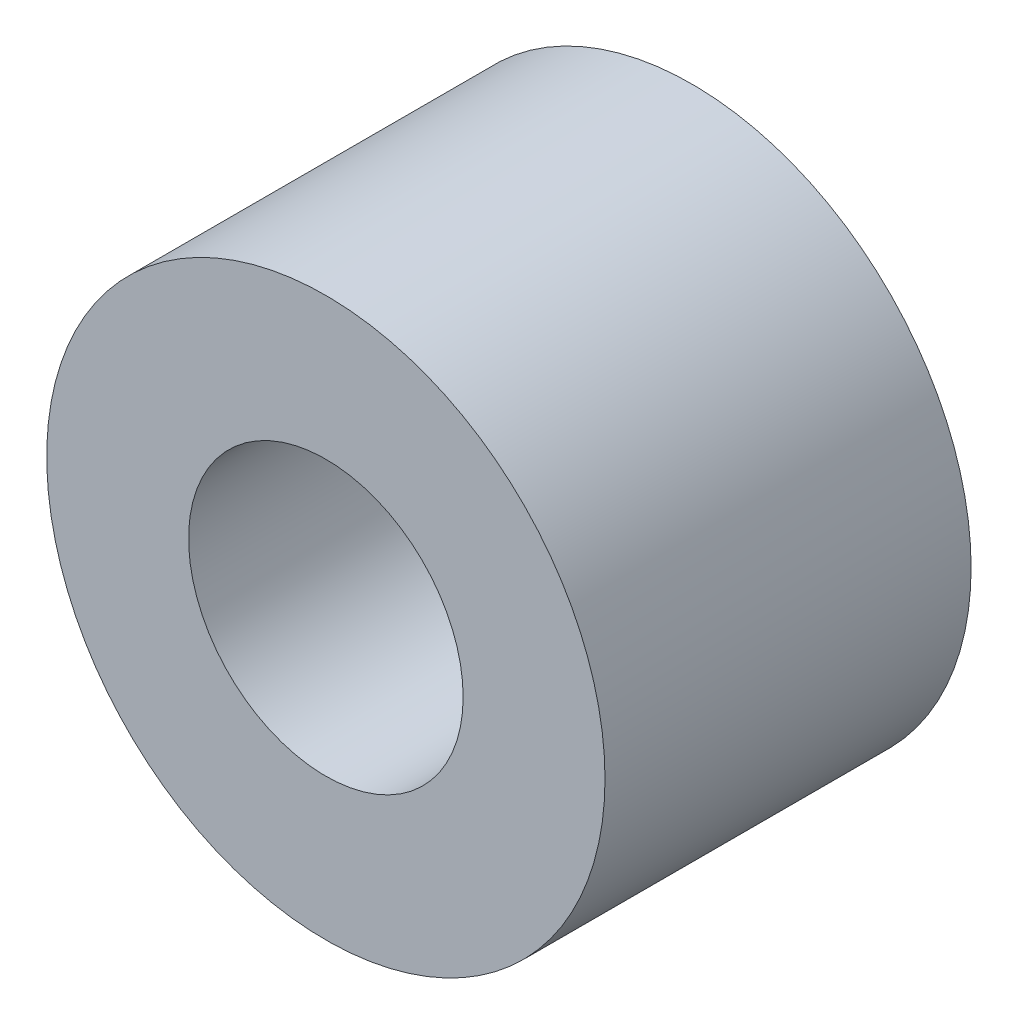
ISO-10303-21;
HEADER;
FILE_DESCRIPTION(('STEP AP214'),'2;1');
FILE_NAME('part.step','',(''),(''),'','','');
FILE_SCHEMA(('AUTOMOTIVE_DESIGN { 1 0 10303 214 1 1 1 1 }'));
ENDSEC;
DATA;
#1=APPLICATION_CONTEXT('core data for automotive mechanical design processes');
#2=APPLICATION_PROTOCOL_DEFINITION('international standard','automotive_design',2000,#1);
#3=PRODUCT_CONTEXT('',#1,'mechanical');
#4=PRODUCT('Part','Part','',(#3));
#5=PRODUCT_RELATED_PRODUCT_CATEGORY('part','',(#4));
#6=PRODUCT_DEFINITION_FORMATION('','',#4);
#7=PRODUCT_DEFINITION_CONTEXT('part definition',#1,'design');
#8=PRODUCT_DEFINITION('design','',#6,#7);
#9=PRODUCT_DEFINITION_SHAPE('','',#8);
#10=(LENGTH_UNIT() NAMED_UNIT(*) SI_UNIT(.MILLI.,.METRE.));
#11=(NAMED_UNIT(*) PLANE_ANGLE_UNIT() SI_UNIT($,.RADIAN.));
#12=(NAMED_UNIT(*) SI_UNIT($,.STERADIAN.) SOLID_ANGLE_UNIT());
#13=UNCERTAINTY_MEASURE_WITH_UNIT(LENGTH_MEASURE(1.E-05),#10,'distance_accuracy_value','');
#14=(GEOMETRIC_REPRESENTATION_CONTEXT(3) GLOBAL_UNCERTAINTY_ASSIGNED_CONTEXT((#13)) GLOBAL_UNIT_ASSIGNED_CONTEXT((#10,
#11,#12)) REPRESENTATION_CONTEXT('',''));
#15=CARTESIAN_POINT('',(0.,0.,0.));
#16=DIRECTION('',(0.,0.,1.));
#17=DIRECTION('',(1.,0.,0.));
#18=AXIS2_PLACEMENT_3D('',#15,#16,#17);
#19=CARTESIAN_POINT('',(0.,0.,4.));
#20=DIRECTION('',(0.,0.,1.));
#21=DIRECTION('',(1.,0.,0.));
#22=AXIS2_PLACEMENT_3D('',#19,#20,#21);
#23=PLANE('',#22);
#24=CARTESIAN_POINT('',(0.,0.,4.));
#25=DIRECTION('',(0.,0.,1.));
#26=DIRECTION('',(1.,0.,0.));
#27=AXIS2_PLACEMENT_3D('',#24,#25,#26);
#28=CIRCLE('',#27,3.05);
#29=CARTESIAN_POINT('',(3.05,0.,4.));
#30=VERTEX_POINT('',#29);
#31=EDGE_CURVE('E10',#30,#30,#28,.T.);
#32=ORIENTED_EDGE('',*,*,#31,.T.);
#33=EDGE_LOOP('',(#32));
#34=FACE_BOUND('',#33,.T.);
#35=CARTESIAN_POINT('',(0.,0.,4.));
#36=DIRECTION('',(0.,0.,1.));
#37=DIRECTION('',(1.,0.,0.));
#38=AXIS2_PLACEMENT_3D('',#35,#36,#37);
#39=CIRCLE('',#38,1.5);
#40=CARTESIAN_POINT('',(1.5,0.,4.));
#41=VERTEX_POINT('',#40);
#42=EDGE_CURVE('E41',#41,#41,#39,.T.);
#43=ORIENTED_EDGE('',*,*,#42,.F.);
#44=EDGE_LOOP('',(#43));
#45=FACE_BOUND('',#44,.T.);
#46=ADVANCED_FACE('F30',(#34,#45),#23,.T.);
#47=CARTESIAN_POINT('',(0.,0.,0.));
#48=DIRECTION('',(0.,0.,1.));
#49=DIRECTION('',(1.,0.,0.));
#50=AXIS2_PLACEMENT_3D('',#47,#48,#49);
#51=PLANE('',#50);
#52=CARTESIAN_POINT('',(0.,0.,0.));
#53=DIRECTION('',(0.,0.,1.));
#54=DIRECTION('',(1.,0.,0.));
#55=AXIS2_PLACEMENT_3D('',#52,#53,#54);
#56=CIRCLE('',#55,3.05);
#57=CARTESIAN_POINT('',(3.05,0.,0.));
#58=VERTEX_POINT('',#57);
#59=EDGE_CURVE('E34',#58,#58,#56,.T.);
#60=ORIENTED_EDGE('',*,*,#59,.F.);
#61=EDGE_LOOP('',(#60));
#62=FACE_BOUND('',#61,.T.);
#63=CARTESIAN_POINT('',(0.,0.,0.));
#64=DIRECTION('',(0.,0.,1.));
#65=DIRECTION('',(1.,0.,0.));
#66=AXIS2_PLACEMENT_3D('',#63,#64,#65);
#67=CIRCLE('',#66,1.5);
#68=CARTESIAN_POINT('',(1.5,0.,0.));
#69=VERTEX_POINT('',#68);
#70=EDGE_CURVE('E43',#69,#69,#67,.T.);
#71=ORIENTED_EDGE('',*,*,#70,.T.);
#72=EDGE_LOOP('',(#71));
#73=FACE_BOUND('',#72,.T.);
#74=ADVANCED_FACE('F53',(#62,#73),#51,.F.);
#75=CARTESIAN_POINT('',(0.,0.,4.));
#76=DIRECTION('',(0.,0.,-1.));
#77=DIRECTION('',(-1.,0.,0.));
#78=AXIS2_PLACEMENT_3D('',#75,#76,#77);
#79=CYLINDRICAL_SURFACE('',#78,3.05);
#80=ORIENTED_EDGE('',*,*,#31,.F.);
#81=EDGE_LOOP('',(#80));
#82=FACE_BOUND('',#81,.T.);
#83=ORIENTED_EDGE('',*,*,#59,.T.);
#84=EDGE_LOOP('',(#83));
#85=FACE_BOUND('',#84,.T.);
#86=ADVANCED_FACE('F32',(#82,#85),#79,.T.);
#87=CARTESIAN_POINT('',(0.,0.,4.));
#88=DIRECTION('',(0.,0.,-1.));
#89=DIRECTION('',(-1.,0.,0.));
#90=AXIS2_PLACEMENT_3D('',#87,#88,#89);
#91=CYLINDRICAL_SURFACE('',#90,1.5);
#92=ORIENTED_EDGE('',*,*,#42,.T.);
#93=EDGE_LOOP('',(#92));
#94=FACE_BOUND('',#93,.T.);
#95=ORIENTED_EDGE('',*,*,#70,.F.);
#96=EDGE_LOOP('',(#95));
#97=FACE_BOUND('',#96,.T.);
#98=ADVANCED_FACE('F49',(#94,#97),#91,.F.);
#99=CLOSED_SHELL('',(#46,#74,#86,#98));
#100=MANIFOLD_SOLID_BREP('B2',#99);
#101=ADVANCED_BREP_SHAPE_REPRESENTATION('',(#18,#100),#14);
#102=SHAPE_DEFINITION_REPRESENTATION(#9,#101);
ENDSEC;
END-ISO-10303-21;
